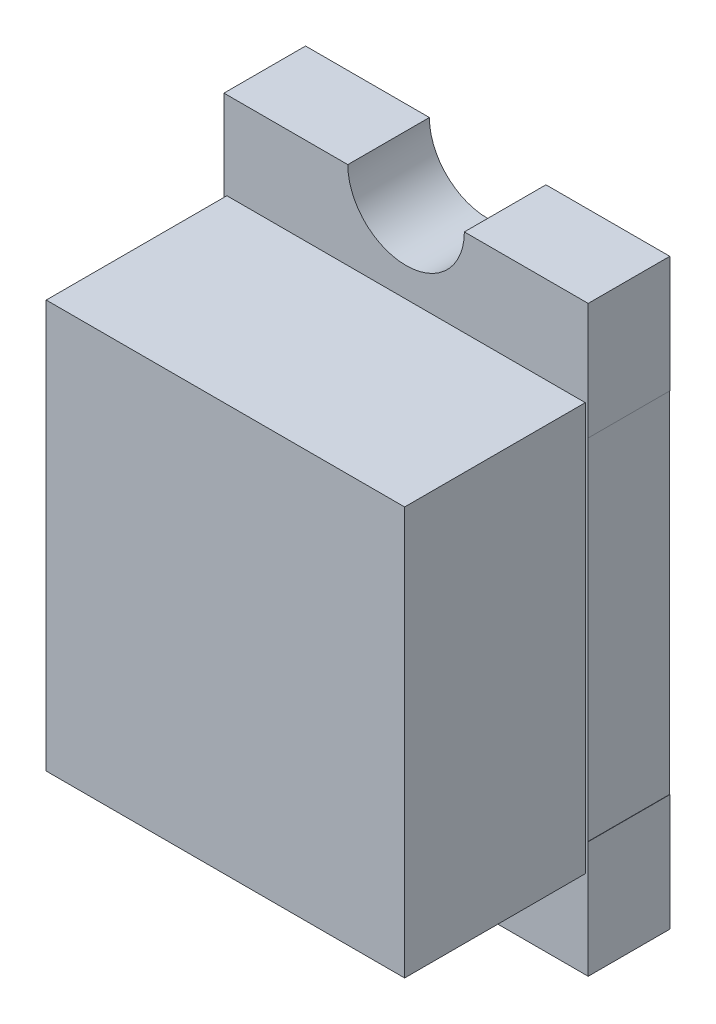
ISO-10303-21;
HEADER;
FILE_DESCRIPTION(('STEP AP214'),'2;1');
FILE_NAME('part.step','',(''),(''),'','','');
FILE_SCHEMA(('AUTOMOTIVE_DESIGN { 1 0 10303 214 1 1 1 1 }'));
ENDSEC;
DATA;
#1=APPLICATION_CONTEXT('core data for automotive mechanical design processes');
#2=APPLICATION_PROTOCOL_DEFINITION('international standard','automotive_design',2000,#1);
#3=PRODUCT_CONTEXT('',#1,'mechanical');
#4=PRODUCT('Part','Part','',(#3));
#5=PRODUCT_RELATED_PRODUCT_CATEGORY('part','',(#4));
#6=PRODUCT_DEFINITION_FORMATION('','',#4);
#7=PRODUCT_DEFINITION_CONTEXT('part definition',#1,'design');
#8=PRODUCT_DEFINITION('design','',#6,#7);
#9=PRODUCT_DEFINITION_SHAPE('','',#8);
#10=(LENGTH_UNIT() NAMED_UNIT(*) SI_UNIT(.MILLI.,.METRE.));
#11=(NAMED_UNIT(*) PLANE_ANGLE_UNIT() SI_UNIT($,.RADIAN.));
#12=(NAMED_UNIT(*) SI_UNIT($,.STERADIAN.) SOLID_ANGLE_UNIT());
#13=UNCERTAINTY_MEASURE_WITH_UNIT(LENGTH_MEASURE(1.E-05),#10,'distance_accuracy_value','');
#14=(GEOMETRIC_REPRESENTATION_CONTEXT(3) GLOBAL_UNCERTAINTY_ASSIGNED_CONTEXT((#13)) GLOBAL_UNIT_ASSIGNED_CONTEXT((#10,
#11,#12)) REPRESENTATION_CONTEXT('',''));
#15=CARTESIAN_POINT('',(0.,0.,0.));
#16=DIRECTION('',(0.,0.,1.));
#17=DIRECTION('',(1.,0.,0.));
#18=AXIS2_PLACEMENT_3D('',#15,#16,#17);
#19=CARTESIAN_POINT('',(0.,1.,0.));
#20=DIRECTION('',(0.,0.,1.));
#21=DIRECTION('',(0.,-1.,0.));
#22=AXIS2_PLACEMENT_3D('',#19,#20,#21);
#23=CYLINDRICAL_SURFACE('',#22,0.2);
#24=DIRECTION('',(0.,0.,1.));
#25=VECTOR('',#24,1.);
#26=CARTESIAN_POINT('',(-0.2,1.,0.));
#27=LINE('',#26,#25);
#28=CARTESIAN_POINT('',(-0.2,1.,0.));
#29=VERTEX_POINT('',#28);
#30=CARTESIAN_POINT('',(-0.2,1.,0.28));
#31=VERTEX_POINT('',#30);
#32=EDGE_CURVE('E455',#29,#31,#27,.T.);
#33=ORIENTED_EDGE('',*,*,#32,.T.);
#34=CARTESIAN_POINT('',(0.,1.,0.28));
#35=DIRECTION('',(0.,0.,1.));
#36=DIRECTION('',(0.,1.,0.));
#37=AXIS2_PLACEMENT_3D('',#34,#35,#36);
#38=CIRCLE('',#37,0.2);
#39=CARTESIAN_POINT('',(0.2,1.,0.28));
#40=VERTEX_POINT('',#39);
#41=EDGE_CURVE('E367',#31,#40,#38,.T.);
#42=ORIENTED_EDGE('',*,*,#41,.T.);
#43=DIRECTION('',(0.,0.,1.));
#44=VECTOR('',#43,1.);
#45=CARTESIAN_POINT('',(0.2,1.,0.));
#46=LINE('',#45,#44);
#47=CARTESIAN_POINT('',(0.2,1.,0.));
#48=VERTEX_POINT('',#47);
#49=EDGE_CURVE('E359',#48,#40,#46,.T.);
#50=ORIENTED_EDGE('',*,*,#49,.F.);
#51=CARTESIAN_POINT('',(0.,1.,0.));
#52=DIRECTION('',(0.,0.,1.));
#53=DIRECTION('',(0.,1.,0.));
#54=AXIS2_PLACEMENT_3D('',#51,#52,#53);
#55=CIRCLE('',#54,0.2);
#56=EDGE_CURVE('E294',#29,#48,#55,.T.);
#57=ORIENTED_EDGE('',*,*,#56,.F.);
#58=EDGE_LOOP('',(#33,#42,#50,#57));
#59=FACE_BOUND('',#58,.T.);
#60=ADVANCED_FACE('F16',(#59),#23,.F.);
#61=CARTESIAN_POINT('',(0.624,-0.6,1.480000416667));
#62=DIRECTION('',(0.,-1.,0.));
#63=DIRECTION('',(-1.,0.,0.));
#64=AXIS2_PLACEMENT_3D('',#61,#62,#63);
#65=PLANE('',#64);
#66=DIRECTION('',(0.,0.,-1.));
#67=VECTOR('',#66,1.);
#68=CARTESIAN_POINT('',(0.625,-0.6,1.480000416667));
#69=LINE('',#68,#67);
#70=CARTESIAN_POINT('',(0.625,-0.6,0.28));
#71=VERTEX_POINT('',#70);
#72=CARTESIAN_POINT('',(0.625,-0.6,0.));
#73=VERTEX_POINT('',#72);
#74=EDGE_CURVE('E265',#71,#73,#69,.T.);
#75=ORIENTED_EDGE('',*,*,#74,.T.);
#76=DIRECTION('',(-1.,0.,0.));
#77=VECTOR('',#76,1.);
#78=CARTESIAN_POINT('',(0.624,-0.6,0.));
#79=LINE('',#78,#77);
#80=CARTESIAN_POINT('',(0.624,-0.6,0.));
#81=VERTEX_POINT('',#80);
#82=EDGE_CURVE('E319',#73,#81,#79,.T.);
#83=ORIENTED_EDGE('',*,*,#82,.T.);
#84=DIRECTION('',(0.,0.,-1.));
#85=VECTOR('',#84,1.);
#86=CARTESIAN_POINT('',(0.624,-0.6,1.480000416667));
#87=LINE('',#86,#85);
#88=CARTESIAN_POINT('',(0.624,-0.6,0.28));
#89=VERTEX_POINT('',#88);
#90=EDGE_CURVE('E27',#89,#81,#87,.T.);
#91=ORIENTED_EDGE('',*,*,#90,.F.);
#92=DIRECTION('',(-1.,0.,0.));
#93=VECTOR('',#92,1.);
#94=CARTESIAN_POINT('',(0.624,-0.6,0.28));
#95=LINE('',#94,#93);
#96=EDGE_CURVE('E380',#71,#89,#95,.T.);
#97=ORIENTED_EDGE('',*,*,#96,.F.);
#98=EDGE_LOOP('',(#75,#83,#91,#97));
#99=FACE_BOUND('',#98,.T.);
#100=ADVANCED_FACE('F497',(#99),#65,.F.);
#101=CARTESIAN_POINT('',(0.624,0.6,1.480000416667));
#102=DIRECTION('',(0.,1.,0.));
#103=DIRECTION('',(1.,0.,0.));
#104=AXIS2_PLACEMENT_3D('',#101,#102,#103);
#105=PLANE('',#104);
#106=DIRECTION('',(0.,0.,-1.));
#107=VECTOR('',#106,1.);
#108=CARTESIAN_POINT('',(0.624,0.6,1.480000416667));
#109=LINE('',#108,#107);
#110=CARTESIAN_POINT('',(0.624,0.6,0.28));
#111=VERTEX_POINT('',#110);
#112=CARTESIAN_POINT('',(0.624,0.6,0.));
#113=VERTEX_POINT('',#112);
#114=EDGE_CURVE('E11',#111,#113,#109,.T.);
#115=ORIENTED_EDGE('',*,*,#114,.T.);
#116=DIRECTION('',(1.,0.,0.));
#117=VECTOR('',#116,1.);
#118=CARTESIAN_POINT('',(0.624,0.6,0.));
#119=LINE('',#118,#117);
#120=CARTESIAN_POINT('',(0.625,0.6,0.));
#121=VERTEX_POINT('',#120);
#122=EDGE_CURVE('E257',#113,#121,#119,.T.);
#123=ORIENTED_EDGE('',*,*,#122,.T.);
#124=DIRECTION('',(0.,0.,-1.));
#125=VECTOR('',#124,1.);
#126=CARTESIAN_POINT('',(0.625,0.6,1.480000416667));
#127=LINE('',#126,#125);
#128=CARTESIAN_POINT('',(0.625,0.6,0.28));
#129=VERTEX_POINT('',#128);
#130=EDGE_CURVE('E288',#129,#121,#127,.T.);
#131=ORIENTED_EDGE('',*,*,#130,.F.);
#132=DIRECTION('',(1.,0.,0.));
#133=VECTOR('',#132,1.);
#134=CARTESIAN_POINT('',(0.624,0.6,0.28));
#135=LINE('',#134,#133);
#136=EDGE_CURVE('E364',#111,#129,#135,.T.);
#137=ORIENTED_EDGE('',*,*,#136,.F.);
#138=EDGE_LOOP('',(#115,#123,#131,#137));
#139=FACE_BOUND('',#138,.T.);
#140=ADVANCED_FACE('F503',(#139),#105,.F.);
#141=CARTESIAN_POINT('',(0.624,0.6,1.480000416667));
#142=DIRECTION('',(-1.,0.,0.));
#143=DIRECTION('',(0.,0.,1.));
#144=AXIS2_PLACEMENT_3D('',#141,#142,#143);
#145=PLANE('',#144);
#146=ORIENTED_EDGE('',*,*,#90,.T.);
#147=DIRECTION('',(0.,1.,0.));
#148=VECTOR('',#147,1.);
#149=CARTESIAN_POINT('',(0.624,0.6,0.));
#150=LINE('',#149,#148);
#151=CARTESIAN_POINT('',(0.624,0.,0.));
#152=VERTEX_POINT('',#151);
#153=EDGE_CURVE('E303',#81,#152,#150,.T.);
#154=ORIENTED_EDGE('',*,*,#153,.T.);
#155=DIRECTION('',(0.,1.,0.));
#156=VECTOR('',#155,1.);
#157=CARTESIAN_POINT('',(0.624,0.6,0.));
#158=LINE('',#157,#156);
#159=CARTESIAN_POINT('',(0.624,0.416,0.));
#160=VERTEX_POINT('',#159);
#161=EDGE_CURVE('E215',#152,#160,#158,.T.);
#162=ORIENTED_EDGE('',*,*,#161,.T.);
#163=DIRECTION('',(0.,1.,0.));
#164=VECTOR('',#163,1.);
#165=CARTESIAN_POINT('',(0.624,0.6,0.));
#166=LINE('',#165,#164);
#167=EDGE_CURVE('E295',#160,#113,#166,.T.);
#168=ORIENTED_EDGE('',*,*,#167,.T.);
#169=ORIENTED_EDGE('',*,*,#114,.F.);
#170=DIRECTION('',(0.,1.,0.));
#171=VECTOR('',#170,1.);
#172=CARTESIAN_POINT('',(0.624,0.6,0.28));
#173=LINE('',#172,#171);
#174=EDGE_CURVE('E368',#89,#111,#173,.T.);
#175=ORIENTED_EDGE('',*,*,#174,.F.);
#176=EDGE_LOOP('',(#146,#154,#162,#168,#169,#175));
#177=FACE_BOUND('',#176,.T.);
#178=ADVANCED_FACE('F515',(#177),#145,.F.);
#179=CARTESIAN_POINT('',(-0.625,-0.6,1.480000416667));
#180=DIRECTION('',(0.,-1.,0.));
#181=DIRECTION('',(-1.,0.,0.));
#182=AXIS2_PLACEMENT_3D('',#179,#180,#181);
#183=PLANE('',#182);
#184=DIRECTION('',(0.,0.,-1.));
#185=VECTOR('',#184,1.);
#186=CARTESIAN_POINT('',(-0.624,-0.6,1.480000416667));
#187=LINE('',#186,#185);
#188=CARTESIAN_POINT('',(-0.624,-0.6,0.28));
#189=VERTEX_POINT('',#188);
#190=CARTESIAN_POINT('',(-0.624,-0.6,0.));
#191=VERTEX_POINT('',#190);
#192=EDGE_CURVE('E284',#189,#191,#187,.T.);
#193=ORIENTED_EDGE('',*,*,#192,.T.);
#194=DIRECTION('',(-1.,0.,0.));
#195=VECTOR('',#194,1.);
#196=CARTESIAN_POINT('',(-0.625,-0.6,0.));
#197=LINE('',#196,#195);
#198=CARTESIAN_POINT('',(-0.625,-0.6,0.));
#199=VERTEX_POINT('',#198);
#200=EDGE_CURVE('E324',#191,#199,#197,.T.);
#201=ORIENTED_EDGE('',*,*,#200,.T.);
#202=DIRECTION('',(0.,0.,-1.));
#203=VECTOR('',#202,1.);
#204=CARTESIAN_POINT('',(-0.625,-0.6,1.480000416667));
#205=LINE('',#204,#203);
#206=CARTESIAN_POINT('',(-0.625,-0.6,0.28));
#207=VERTEX_POINT('',#206);
#208=EDGE_CURVE('E280',#207,#199,#205,.T.);
#209=ORIENTED_EDGE('',*,*,#208,.F.);
#210=DIRECTION('',(-1.,0.,0.));
#211=VECTOR('',#210,1.);
#212=CARTESIAN_POINT('',(-0.625,-0.6,0.28));
#213=LINE('',#212,#211);
#214=EDGE_CURVE('E258',#189,#207,#213,.T.);
#215=ORIENTED_EDGE('',*,*,#214,.F.);
#216=EDGE_LOOP('',(#193,#201,#209,#215));
#217=FACE_BOUND('',#216,.T.);
#218=ADVANCED_FACE('F518',(#217),#183,.F.);
#219=CARTESIAN_POINT('',(-0.624,0.6,1.480000416667));
#220=DIRECTION('',(1.,0.,0.));
#221=DIRECTION('',(0.,-1.,0.));
#222=AXIS2_PLACEMENT_3D('',#219,#220,#221);
#223=PLANE('',#222);
#224=DIRECTION('',(0.,0.,-1.));
#225=VECTOR('',#224,1.);
#226=CARTESIAN_POINT('',(-0.624,0.6,1.480000416667));
#227=LINE('',#226,#225);
#228=CARTESIAN_POINT('',(-0.624,0.6,0.28));
#229=VERTEX_POINT('',#228);
#230=CARTESIAN_POINT('',(-0.624,0.6,0.));
#231=VERTEX_POINT('',#230);
#232=EDGE_CURVE('E85',#229,#231,#227,.T.);
#233=ORIENTED_EDGE('',*,*,#232,.T.);
#234=DIRECTION('',(0.,-1.,0.));
#235=VECTOR('',#234,1.);
#236=CARTESIAN_POINT('',(-0.624,0.6,0.));
#237=LINE('',#236,#235);
#238=CARTESIAN_POINT('',(-0.624,0.416,0.));
#239=VERTEX_POINT('',#238);
#240=EDGE_CURVE('E210',#231,#239,#237,.T.);
#241=ORIENTED_EDGE('',*,*,#240,.T.);
#242=DIRECTION('',(0.,-1.,0.));
#243=VECTOR('',#242,1.);
#244=CARTESIAN_POINT('',(-0.624,0.6,0.));
#245=LINE('',#244,#243);
#246=CARTESIAN_POINT('',(-0.624,0.,0.));
#247=VERTEX_POINT('',#246);
#248=EDGE_CURVE('E203',#239,#247,#245,.T.);
#249=ORIENTED_EDGE('',*,*,#248,.T.);
#250=DIRECTION('',(0.,-1.,0.));
#251=VECTOR('',#250,1.);
#252=CARTESIAN_POINT('',(-0.624,0.6,0.));
#253=LINE('',#252,#251);
#254=EDGE_CURVE('E207',#247,#191,#253,.T.);
#255=ORIENTED_EDGE('',*,*,#254,.T.);
#256=ORIENTED_EDGE('',*,*,#192,.F.);
#257=DIRECTION('',(0.,-1.,0.));
#258=VECTOR('',#257,1.);
#259=CARTESIAN_POINT('',(-0.624,0.6,0.28));
#260=LINE('',#259,#258);
#261=EDGE_CURVE('E261',#229,#189,#260,.T.);
#262=ORIENTED_EDGE('',*,*,#261,.F.);
#263=EDGE_LOOP('',(#233,#241,#249,#255,#256,#262));
#264=FACE_BOUND('',#263,.T.);
#265=ADVANCED_FACE('F205',(#264),#223,.F.);
#266=CARTESIAN_POINT('',(-0.625,0.6,1.480000416667));
#267=DIRECTION('',(0.,1.,0.));
#268=DIRECTION('',(1.,0.,0.));
#269=AXIS2_PLACEMENT_3D('',#266,#267,#268);
#270=PLANE('',#269);
#271=DIRECTION('',(0.,0.,-1.));
#272=VECTOR('',#271,1.);
#273=CARTESIAN_POINT('',(-0.625,0.6,1.480000416667));
#274=LINE('',#273,#272);
#275=CARTESIAN_POINT('',(-0.625,0.6,0.28));
#276=VERTEX_POINT('',#275);
#277=CARTESIAN_POINT('',(-0.625,0.6,0.));
#278=VERTEX_POINT('',#277);
#279=EDGE_CURVE('E285',#276,#278,#274,.T.);
#280=ORIENTED_EDGE('',*,*,#279,.T.);
#281=DIRECTION('',(1.,0.,0.));
#282=VECTOR('',#281,1.);
#283=CARTESIAN_POINT('',(-0.625,0.6,0.));
#284=LINE('',#283,#282);
#285=EDGE_CURVE('E253',#278,#231,#284,.T.);
#286=ORIENTED_EDGE('',*,*,#285,.T.);
#287=ORIENTED_EDGE('',*,*,#232,.F.);
#288=DIRECTION('',(1.,0.,0.));
#289=VECTOR('',#288,1.);
#290=CARTESIAN_POINT('',(-0.625,0.6,0.28));
#291=LINE('',#290,#289);
#292=EDGE_CURVE('E429',#276,#229,#291,.T.);
#293=ORIENTED_EDGE('',*,*,#292,.F.);
#294=EDGE_LOOP('',(#280,#286,#287,#293));
#295=FACE_BOUND('',#294,.T.);
#296=ADVANCED_FACE('F492',(#295),#270,.F.);
#297=CARTESIAN_POINT('',(0.,0.,0.9));
#298=DIRECTION('',(0.,0.,1.));
#299=DIRECTION('',(1.,0.,0.));
#300=AXIS2_PLACEMENT_3D('',#297,#298,#299);
#301=PLANE('',#300);
#302=DIRECTION('',(0.,-1.,0.));
#303=VECTOR('',#302,1.);
#304=CARTESIAN_POINT('',(-0.615,0.7,0.9));
#305=LINE('',#304,#303);
#306=CARTESIAN_POINT('',(-0.615,0.7,0.9));
#307=VERTEX_POINT('',#306);
#308=CARTESIAN_POINT('',(-0.615,-0.7,0.9));
#309=VERTEX_POINT('',#308);
#310=EDGE_CURVE('E246',#307,#309,#305,.T.);
#311=ORIENTED_EDGE('',*,*,#310,.T.);
#312=DIRECTION('',(1.,0.,0.));
#313=VECTOR('',#312,1.);
#314=CARTESIAN_POINT('',(0.615,-0.7,0.9));
#315=LINE('',#314,#313);
#316=CARTESIAN_POINT('',(0.615,-0.7,0.9));
#317=VERTEX_POINT('',#316);
#318=EDGE_CURVE('E277',#309,#317,#315,.T.);
#319=ORIENTED_EDGE('',*,*,#318,.T.);
#320=DIRECTION('',(0.,1.,0.));
#321=VECTOR('',#320,1.);
#322=CARTESIAN_POINT('',(0.615,-0.7,0.9));
#323=LINE('',#322,#321);
#324=CARTESIAN_POINT('',(0.615,0.7,0.9));
#325=VERTEX_POINT('',#324);
#326=EDGE_CURVE('E276',#317,#325,#323,.T.);
#327=ORIENTED_EDGE('',*,*,#326,.T.);
#328=DIRECTION('',(-1.,0.,0.));
#329=VECTOR('',#328,1.);
#330=CARTESIAN_POINT('',(-0.615,0.7,0.9));
#331=LINE('',#330,#329);
#332=EDGE_CURVE('E41',#325,#307,#331,.T.);
#333=ORIENTED_EDGE('',*,*,#332,.T.);
#334=EDGE_LOOP('',(#311,#319,#327,#333));
#335=FACE_BOUND('',#334,.T.);
#336=ADVANCED_FACE('F465',(#335),#301,.T.);
#337=CARTESIAN_POINT('',(-0.615,0.7,0.9));
#338=DIRECTION('',(0.,-1.,0.));
#339=DIRECTION('',(-1.,0.,0.));
#340=AXIS2_PLACEMENT_3D('',#337,#338,#339);
#341=PLANE('',#340);
#342=DIRECTION('',(-1.,0.,0.));
#343=VECTOR('',#342,1.);
#344=CARTESIAN_POINT('',(-0.615,0.7,0.28));
#345=LINE('',#344,#343);
#346=CARTESIAN_POINT('',(0.615,0.7,0.28));
#347=VERTEX_POINT('',#346);
#348=CARTESIAN_POINT('',(-0.615,0.7,0.28));
#349=VERTEX_POINT('',#348);
#350=EDGE_CURVE('E348',#347,#349,#345,.T.);
#351=ORIENTED_EDGE('',*,*,#350,.T.);
#352=DIRECTION('',(0.,0.,-1.));
#353=VECTOR('',#352,1.);
#354=CARTESIAN_POINT('',(-0.615,0.7,0.9));
#355=LINE('',#354,#353);
#356=EDGE_CURVE('E242',#307,#349,#355,.T.);
#357=ORIENTED_EDGE('',*,*,#356,.F.);
#358=ORIENTED_EDGE('',*,*,#332,.F.);
#359=DIRECTION('',(0.,0.,-1.));
#360=VECTOR('',#359,1.);
#361=CARTESIAN_POINT('',(0.615,0.7,0.9));
#362=LINE('',#361,#360);
#363=EDGE_CURVE('E273',#325,#347,#362,.T.);
#364=ORIENTED_EDGE('',*,*,#363,.T.);
#365=EDGE_LOOP('',(#351,#357,#358,#364));
#366=FACE_BOUND('',#365,.T.);
#367=ADVANCED_FACE('F483',(#366),#341,.F.);
#368=CARTESIAN_POINT('',(0.615,-0.7,0.9));
#369=DIRECTION('',(-1.,0.,0.));
#370=DIRECTION('',(0.,0.,1.));
#371=AXIS2_PLACEMENT_3D('',#368,#369,#370);
#372=PLANE('',#371);
#373=DIRECTION('',(0.,1.,0.));
#374=VECTOR('',#373,1.);
#375=CARTESIAN_POINT('',(0.615,-0.7,0.28));
#376=LINE('',#375,#374);
#377=CARTESIAN_POINT('',(0.615,-0.7,0.28));
#378=VERTEX_POINT('',#377);
#379=EDGE_CURVE('E272',#378,#347,#376,.T.);
#380=ORIENTED_EDGE('',*,*,#379,.T.);
#381=ORIENTED_EDGE('',*,*,#363,.F.);
#382=ORIENTED_EDGE('',*,*,#326,.F.);
#383=DIRECTION('',(0.,0.,-1.));
#384=VECTOR('',#383,1.);
#385=CARTESIAN_POINT('',(0.615,-0.7,0.9));
#386=LINE('',#385,#384);
#387=EDGE_CURVE('E245',#317,#378,#386,.T.);
#388=ORIENTED_EDGE('',*,*,#387,.T.);
#389=EDGE_LOOP('',(#380,#381,#382,#388));
#390=FACE_BOUND('',#389,.T.);
#391=ADVANCED_FACE('F480',(#390),#372,.F.);
#392=CARTESIAN_POINT('',(0.615,-0.7,0.9));
#393=DIRECTION('',(0.,1.,0.));
#394=DIRECTION('',(1.,0.,0.));
#395=AXIS2_PLACEMENT_3D('',#392,#393,#394);
#396=PLANE('',#395);
#397=DIRECTION('',(1.,0.,0.));
#398=VECTOR('',#397,1.);
#399=CARTESIAN_POINT('',(0.615,-0.7,0.28));
#400=LINE('',#399,#398);
#401=CARTESIAN_POINT('',(-0.615,-0.7,0.28));
#402=VERTEX_POINT('',#401);
#403=EDGE_CURVE('E267',#402,#378,#400,.T.);
#404=ORIENTED_EDGE('',*,*,#403,.T.);
#405=ORIENTED_EDGE('',*,*,#387,.F.);
#406=ORIENTED_EDGE('',*,*,#318,.F.);
#407=DIRECTION('',(0.,0.,-1.));
#408=VECTOR('',#407,1.);
#409=CARTESIAN_POINT('',(-0.615,-0.7,0.9));
#410=LINE('',#409,#408);
#411=EDGE_CURVE('E271',#309,#402,#410,.T.);
#412=ORIENTED_EDGE('',*,*,#411,.T.);
#413=EDGE_LOOP('',(#404,#405,#406,#412));
#414=FACE_BOUND('',#413,.T.);
#415=ADVANCED_FACE('F473',(#414),#396,.F.);
#416=CARTESIAN_POINT('',(-0.615,0.7,0.9));
#417=DIRECTION('',(1.,0.,0.));
#418=DIRECTION('',(0.,0.,1.));
#419=AXIS2_PLACEMENT_3D('',#416,#417,#418);
#420=PLANE('',#419);
#421=DIRECTION('',(0.,-1.,0.));
#422=VECTOR('',#421,1.);
#423=CARTESIAN_POINT('',(-0.615,0.7,0.28));
#424=LINE('',#423,#422);
#425=EDGE_CURVE('E20',#349,#402,#424,.T.);
#426=ORIENTED_EDGE('',*,*,#425,.T.);
#427=ORIENTED_EDGE('',*,*,#411,.F.);
#428=ORIENTED_EDGE('',*,*,#310,.F.);
#429=ORIENTED_EDGE('',*,*,#356,.T.);
#430=EDGE_LOOP('',(#426,#427,#428,#429));
#431=FACE_BOUND('',#430,.T.);
#432=ADVANCED_FACE('F469',(#431),#420,.F.);
#433=CARTESIAN_POINT('',(0.,0.,0.28));
#434=DIRECTION('',(0.,0.,1.));
#435=DIRECTION('',(1.,0.,0.));
#436=AXIS2_PLACEMENT_3D('',#433,#434,#435);
#437=PLANE('',#436);
#438=ORIENTED_EDGE('',*,*,#425,.F.);
#439=ORIENTED_EDGE('',*,*,#350,.F.);
#440=ORIENTED_EDGE('',*,*,#379,.F.);
#441=ORIENTED_EDGE('',*,*,#403,.F.);
#442=EDGE_LOOP('',(#438,#439,#440,#441));
#443=FACE_BOUND('',#442,.T.);
#444=CARTESIAN_POINT('',(0.,-1.,0.28));
#445=DIRECTION('',(0.,0.,1.));
#446=DIRECTION('',(0.,1.,0.));
#447=AXIS2_PLACEMENT_3D('',#444,#445,#446);
#448=CIRCLE('',#447,0.2);
#449=CARTESIAN_POINT('',(0.2,-1.,0.28));
#450=VERTEX_POINT('',#449);
#451=CARTESIAN_POINT('',(-0.2,-1.,0.28));
#452=VERTEX_POINT('',#451);
#453=EDGE_CURVE('E347',#450,#452,#448,.T.);
#454=ORIENTED_EDGE('',*,*,#453,.F.);
#455=DIRECTION('',(1.,0.,0.));
#456=VECTOR('',#455,1.);
#457=CARTESIAN_POINT('',(-0.625,-1.,0.28));
#458=LINE('',#457,#456);
#459=CARTESIAN_POINT('',(0.625,-1.,0.28));
#460=VERTEX_POINT('',#459);
#461=EDGE_CURVE('E266',#450,#460,#458,.T.);
#462=ORIENTED_EDGE('',*,*,#461,.T.);
#463=DIRECTION('',(0.,1.,0.));
#464=VECTOR('',#463,1.);
#465=CARTESIAN_POINT('',(0.625,-1.,0.28));
#466=LINE('',#465,#464);
#467=EDGE_CURVE('E216',#460,#71,#466,.T.);
#468=ORIENTED_EDGE('',*,*,#467,.T.);
#469=ORIENTED_EDGE('',*,*,#96,.T.);
#470=ORIENTED_EDGE('',*,*,#174,.T.);
#471=ORIENTED_EDGE('',*,*,#136,.T.);
#472=DIRECTION('',(0.,1.,0.));
#473=VECTOR('',#472,1.);
#474=CARTESIAN_POINT('',(0.625,-1.,0.28));
#475=LINE('',#474,#473);
#476=CARTESIAN_POINT('',(0.625,1.,0.28));
#477=VERTEX_POINT('',#476);
#478=EDGE_CURVE('E328',#129,#477,#475,.T.);
#479=ORIENTED_EDGE('',*,*,#478,.T.);
#480=DIRECTION('',(-1.,0.,0.));
#481=VECTOR('',#480,1.);
#482=CARTESIAN_POINT('',(0.625,1.,0.28));
#483=LINE('',#482,#481);
#484=EDGE_CURVE('E355',#477,#40,#483,.T.);
#485=ORIENTED_EDGE('',*,*,#484,.T.);
#486=ORIENTED_EDGE('',*,*,#41,.F.);
#487=DIRECTION('',(-1.,0.,0.));
#488=VECTOR('',#487,1.);
#489=CARTESIAN_POINT('',(0.625,1.,0.28));
#490=LINE('',#489,#488);
#491=CARTESIAN_POINT('',(-0.625,1.,0.28));
#492=VERTEX_POINT('',#491);
#493=EDGE_CURVE('E452',#31,#492,#490,.T.);
#494=ORIENTED_EDGE('',*,*,#493,.T.);
#495=DIRECTION('',(0.,-1.,0.));
#496=VECTOR('',#495,1.);
#497=CARTESIAN_POINT('',(-0.625,1.,0.28));
#498=LINE('',#497,#496);
#499=EDGE_CURVE('E287',#492,#276,#498,.T.);
#500=ORIENTED_EDGE('',*,*,#499,.T.);
#501=ORIENTED_EDGE('',*,*,#292,.T.);
#502=ORIENTED_EDGE('',*,*,#261,.T.);
#503=ORIENTED_EDGE('',*,*,#214,.T.);
#504=DIRECTION('',(0.,-1.,0.));
#505=VECTOR('',#504,1.);
#506=CARTESIAN_POINT('',(-0.625,1.,0.28));
#507=LINE('',#506,#505);
#508=CARTESIAN_POINT('',(-0.625,-1.,0.28));
#509=VERTEX_POINT('',#508);
#510=EDGE_CURVE('E418',#207,#509,#507,.T.);
#511=ORIENTED_EDGE('',*,*,#510,.T.);
#512=DIRECTION('',(1.,0.,0.));
#513=VECTOR('',#512,1.);
#514=CARTESIAN_POINT('',(-0.625,-1.,0.28));
#515=LINE('',#514,#513);
#516=EDGE_CURVE('E343',#509,#452,#515,.T.);
#517=ORIENTED_EDGE('',*,*,#516,.T.);
#518=EDGE_LOOP('',(#454,#462,#468,#469,#470,#471,#479,#485,#486,#494,#500,#501,#502,#503,#511,#517));
#519=FACE_BOUND('',#518,.T.);
#520=ADVANCED_FACE('F476',(#443,#519),#437,.T.);
#521=CARTESIAN_POINT('',(0.,0.,0.));
#522=DIRECTION('',(0.,0.,1.));
#523=DIRECTION('',(1.,0.,0.));
#524=AXIS2_PLACEMENT_3D('',#521,#522,#523);
#525=PLANE('',#524);
#526=ORIENTED_EDGE('',*,*,#248,.F.);
#527=DIRECTION('',(1.,0.,0.));
#528=VECTOR('',#527,1.);
#529=CARTESIAN_POINT('',(0.,0.416,0.));
#530=LINE('',#529,#528);
#531=EDGE_CURVE('E298',#239,#160,#530,.T.);
#532=ORIENTED_EDGE('',*,*,#531,.T.);
#533=ORIENTED_EDGE('',*,*,#161,.F.);
#534=DIRECTION('',(-1.,0.,0.));
#535=VECTOR('',#534,1.);
#536=CARTESIAN_POINT('',(0.,0.,0.));
#537=LINE('',#536,#535);
#538=CARTESIAN_POINT('',(0.208,0.,0.));
#539=VERTEX_POINT('',#538);
#540=EDGE_CURVE('E300',#152,#539,#537,.T.);
#541=ORIENTED_EDGE('',*,*,#540,.T.);
#542=DIRECTION('',(0.,-1.,0.));
#543=VECTOR('',#542,1.);
#544=CARTESIAN_POINT('',(0.208,0.,0.));
#545=LINE('',#544,#543);
#546=CARTESIAN_POINT('',(0.208,-0.416,0.));
#547=VERTEX_POINT('',#546);
#548=EDGE_CURVE('E304',#539,#547,#545,.T.);
#549=ORIENTED_EDGE('',*,*,#548,.T.);
#550=DIRECTION('',(-1.,0.,0.));
#551=VECTOR('',#550,1.);
#552=CARTESIAN_POINT('',(0.,-0.416,0.));
#553=LINE('',#552,#551);
#554=CARTESIAN_POINT('',(-0.208,-0.416,0.));
#555=VERTEX_POINT('',#554);
#556=EDGE_CURVE('E307',#547,#555,#553,.T.);
#557=ORIENTED_EDGE('',*,*,#556,.T.);
#558=DIRECTION('',(0.,1.,0.));
#559=VECTOR('',#558,1.);
#560=CARTESIAN_POINT('',(-0.208,0.,0.));
#561=LINE('',#560,#559);
#562=CARTESIAN_POINT('',(-0.208,0.,0.));
#563=VERTEX_POINT('',#562);
#564=EDGE_CURVE('E222',#555,#563,#561,.T.);
#565=ORIENTED_EDGE('',*,*,#564,.T.);
#566=DIRECTION('',(-1.,0.,0.));
#567=VECTOR('',#566,1.);
#568=CARTESIAN_POINT('',(0.,0.,0.));
#569=LINE('',#568,#567);
#570=EDGE_CURVE('E219',#563,#247,#569,.T.);
#571=ORIENTED_EDGE('',*,*,#570,.T.);
#572=EDGE_LOOP('',(#526,#532,#533,#541,#549,#557,#565,#571));
#573=FACE_BOUND('',#572,.T.);
#574=ADVANCED_FACE('F220',(#573),#525,.F.);
#575=CARTESIAN_POINT('',(0.625,-1.,0.9));
#576=DIRECTION('',(-1.,0.,0.));
#577=DIRECTION('',(0.,0.,1.));
#578=AXIS2_PLACEMENT_3D('',#575,#576,#577);
#579=PLANE('',#578);
#580=DIRECTION('',(0.,1.,0.));
#581=VECTOR('',#580,1.);
#582=CARTESIAN_POINT('',(0.625,-1.,0.));
#583=LINE('',#582,#581);
#584=CARTESIAN_POINT('',(0.625,-1.,0.));
#585=VERTEX_POINT('',#584);
#586=EDGE_CURVE('E323',#585,#73,#583,.T.);
#587=ORIENTED_EDGE('',*,*,#586,.T.);
#588=ORIENTED_EDGE('',*,*,#74,.F.);
#589=ORIENTED_EDGE('',*,*,#467,.F.);
#590=DIRECTION('',(0.,0.,-1.));
#591=VECTOR('',#590,1.);
#592=CARTESIAN_POINT('',(0.625,-1.,0.9));
#593=LINE('',#592,#591);
#594=EDGE_CURVE('E262',#460,#585,#593,.T.);
#595=ORIENTED_EDGE('',*,*,#594,.T.);
#596=EDGE_LOOP('',(#587,#588,#589,#595));
#597=FACE_BOUND('',#596,.T.);
#598=ADVANCED_FACE('F853',(#597),#579,.F.);
#599=CARTESIAN_POINT('',(-0.625,-1.,0.9));
#600=DIRECTION('',(0.,1.,0.));
#601=DIRECTION('',(0.,0.,-1.));
#602=AXIS2_PLACEMENT_3D('',#599,#600,#601);
#603=PLANE('',#602);
#604=ORIENTED_EDGE('',*,*,#461,.F.);
#605=DIRECTION('',(0.,0.,1.));
#606=VECTOR('',#605,1.);
#607=CARTESIAN_POINT('',(0.2,-1.,0.));
#608=LINE('',#607,#606);
#609=CARTESIAN_POINT('',(0.2,-1.,0.));
#610=VERTEX_POINT('',#609);
#611=EDGE_CURVE('E251',#610,#450,#608,.T.);
#612=ORIENTED_EDGE('',*,*,#611,.F.);
#613=DIRECTION('',(1.,0.,0.));
#614=VECTOR('',#613,1.);
#615=CARTESIAN_POINT('',(-0.625,-1.,0.));
#616=LINE('',#615,#614);
#617=EDGE_CURVE('E399',#610,#585,#616,.T.);
#618=ORIENTED_EDGE('',*,*,#617,.T.);
#619=ORIENTED_EDGE('',*,*,#594,.F.);
#620=EDGE_LOOP('',(#604,#612,#618,#619));
#621=FACE_BOUND('',#620,.T.);
#622=ADVANCED_FACE('F858',(#621),#603,.F.);
#623=CARTESIAN_POINT('',(-0.625,-1.,0.9));
#624=DIRECTION('',(1.,0.,0.));
#625=DIRECTION('',(0.,-1.,0.));
#626=AXIS2_PLACEMENT_3D('',#623,#624,#625);
#627=PLANE('',#626);
#628=ORIENTED_EDGE('',*,*,#510,.F.);
#629=ORIENTED_EDGE('',*,*,#208,.T.);
#630=DIRECTION('',(0.,-1.,0.));
#631=VECTOR('',#630,1.);
#632=CARTESIAN_POINT('',(-0.625,-1.,0.));
#633=LINE('',#632,#631);
#634=CARTESIAN_POINT('',(-0.625,-1.,0.));
#635=VERTEX_POINT('',#634);
#636=EDGE_CURVE('E240',#199,#635,#633,.T.);
#637=ORIENTED_EDGE('',*,*,#636,.T.);
#638=DIRECTION('',(0.,0.,-1.));
#639=VECTOR('',#638,1.);
#640=CARTESIAN_POINT('',(-0.625,-1.,0.9));
#641=LINE('',#640,#639);
#642=EDGE_CURVE('E338',#509,#635,#641,.T.);
#643=ORIENTED_EDGE('',*,*,#642,.F.);
#644=EDGE_LOOP('',(#628,#629,#637,#643));
#645=FACE_BOUND('',#644,.T.);
#646=ADVANCED_FACE('F542',(#645),#627,.F.);
#647=CARTESIAN_POINT('',(-0.625,1.,0.9));
#648=DIRECTION('',(0.,-1.,0.));
#649=DIRECTION('',(-1.,0.,0.));
#650=AXIS2_PLACEMENT_3D('',#647,#648,#649);
#651=PLANE('',#650);
#652=ORIENTED_EDGE('',*,*,#493,.F.);
#653=ORIENTED_EDGE('',*,*,#32,.F.);
#654=DIRECTION('',(-1.,0.,0.));
#655=VECTOR('',#654,1.);
#656=CARTESIAN_POINT('',(-0.625,1.,0.));
#657=LINE('',#656,#655);
#658=CARTESIAN_POINT('',(-0.625,1.,0.));
#659=VERTEX_POINT('',#658);
#660=EDGE_CURVE('E290',#29,#659,#657,.T.);
#661=ORIENTED_EDGE('',*,*,#660,.T.);
#662=DIRECTION('',(0.,0.,-1.));
#663=VECTOR('',#662,1.);
#664=CARTESIAN_POINT('',(-0.625,1.,0.9));
#665=LINE('',#664,#663);
#666=EDGE_CURVE('E334',#492,#659,#665,.T.);
#667=ORIENTED_EDGE('',*,*,#666,.F.);
#668=EDGE_LOOP('',(#652,#653,#661,#667));
#669=FACE_BOUND('',#668,.T.);
#670=ADVANCED_FACE('F534',(#669),#651,.F.);
#671=CARTESIAN_POINT('',(-0.625,-1.,0.9));
#672=DIRECTION('',(1.,0.,0.));
#673=DIRECTION('',(0.,-1.,0.));
#674=AXIS2_PLACEMENT_3D('',#671,#672,#673);
#675=PLANE('',#674);
#676=DIRECTION('',(0.,-1.,0.));
#677=VECTOR('',#676,1.);
#678=CARTESIAN_POINT('',(-0.625,-1.,0.));
#679=LINE('',#678,#677);
#680=EDGE_CURVE('E256',#659,#278,#679,.T.);
#681=ORIENTED_EDGE('',*,*,#680,.T.);
#682=ORIENTED_EDGE('',*,*,#279,.F.);
#683=ORIENTED_EDGE('',*,*,#499,.F.);
#684=ORIENTED_EDGE('',*,*,#666,.T.);
#685=EDGE_LOOP('',(#681,#682,#683,#684));
#686=FACE_BOUND('',#685,.T.);
#687=ADVANCED_FACE('F532',(#686),#675,.F.);
#688=CARTESIAN_POINT('',(0.625,-1.,0.9));
#689=DIRECTION('',(-1.,0.,0.));
#690=DIRECTION('',(0.,0.,1.));
#691=AXIS2_PLACEMENT_3D('',#688,#689,#690);
#692=PLANE('',#691);
#693=ORIENTED_EDGE('',*,*,#478,.F.);
#694=ORIENTED_EDGE('',*,*,#130,.T.);
#695=DIRECTION('',(0.,1.,0.));
#696=VECTOR('',#695,1.);
#697=CARTESIAN_POINT('',(0.625,-1.,0.));
#698=LINE('',#697,#696);
#699=CARTESIAN_POINT('',(0.625,1.,0.));
#700=VERTEX_POINT('',#699);
#701=EDGE_CURVE('E318',#121,#700,#698,.T.);
#702=ORIENTED_EDGE('',*,*,#701,.T.);
#703=DIRECTION('',(0.,0.,-1.));
#704=VECTOR('',#703,1.);
#705=CARTESIAN_POINT('',(0.625,1.,0.9));
#706=LINE('',#705,#704);
#707=EDGE_CURVE('E236',#477,#700,#706,.T.);
#708=ORIENTED_EDGE('',*,*,#707,.F.);
#709=EDGE_LOOP('',(#693,#694,#702,#708));
#710=FACE_BOUND('',#709,.T.);
#711=ADVANCED_FACE('F525',(#710),#692,.F.);
#712=CARTESIAN_POINT('',(0.,0.,0.));
#713=DIRECTION('',(0.,0.,1.));
#714=DIRECTION('',(1.,0.,0.));
#715=AXIS2_PLACEMENT_3D('',#712,#713,#714);
#716=PLANE('',#715);
#717=ORIENTED_EDGE('',*,*,#617,.F.);
#718=CARTESIAN_POINT('',(0.,-1.,0.));
#719=DIRECTION('',(0.,0.,1.));
#720=DIRECTION('',(0.,1.,0.));
#721=AXIS2_PLACEMENT_3D('',#718,#719,#720);
#722=CIRCLE('',#721,0.2);
#723=CARTESIAN_POINT('',(-0.2,-1.,0.));
#724=VERTEX_POINT('',#723);
#725=EDGE_CURVE('E247',#610,#724,#722,.T.);
#726=ORIENTED_EDGE('',*,*,#725,.T.);
#727=DIRECTION('',(1.,0.,0.));
#728=VECTOR('',#727,1.);
#729=CARTESIAN_POINT('',(-0.625,-1.,0.));
#730=LINE('',#729,#728);
#731=EDGE_CURVE('E344',#635,#724,#730,.T.);
#732=ORIENTED_EDGE('',*,*,#731,.F.);
#733=ORIENTED_EDGE('',*,*,#636,.F.);
#734=ORIENTED_EDGE('',*,*,#200,.F.);
#735=DIRECTION('',(1.,0.,0.));
#736=VECTOR('',#735,1.);
#737=CARTESIAN_POINT('',(0.,-0.6,0.));
#738=LINE('',#737,#736);
#739=EDGE_CURVE('E229',#191,#81,#738,.T.);
#740=ORIENTED_EDGE('',*,*,#739,.T.);
#741=ORIENTED_EDGE('',*,*,#82,.F.);
#742=ORIENTED_EDGE('',*,*,#586,.F.);
#743=EDGE_LOOP('',(#717,#726,#732,#733,#734,#740,#741,#742));
#744=FACE_BOUND('',#743,.T.);
#745=ADVANCED_FACE('F522',(#744),#716,.F.);
#746=CARTESIAN_POINT('',(0.,0.,0.));
#747=DIRECTION('',(0.,0.,1.));
#748=DIRECTION('',(1.,0.,0.));
#749=AXIS2_PLACEMENT_3D('',#746,#747,#748);
#750=PLANE('',#749);
#751=ORIENTED_EDGE('',*,*,#660,.F.);
#752=ORIENTED_EDGE('',*,*,#56,.T.);
#753=DIRECTION('',(-1.,0.,0.));
#754=VECTOR('',#753,1.);
#755=CARTESIAN_POINT('',(-0.625,1.,0.));
#756=LINE('',#755,#754);
#757=EDGE_CURVE('E342',#700,#48,#756,.T.);
#758=ORIENTED_EDGE('',*,*,#757,.F.);
#759=ORIENTED_EDGE('',*,*,#701,.F.);
#760=ORIENTED_EDGE('',*,*,#122,.F.);
#761=DIRECTION('',(-1.,0.,0.));
#762=VECTOR('',#761,1.);
#763=CARTESIAN_POINT('',(0.,0.6,0.));
#764=LINE('',#763,#762);
#765=EDGE_CURVE('E299',#113,#231,#764,.T.);
#766=ORIENTED_EDGE('',*,*,#765,.T.);
#767=ORIENTED_EDGE('',*,*,#285,.F.);
#768=ORIENTED_EDGE('',*,*,#680,.F.);
#769=EDGE_LOOP('',(#751,#752,#758,#759,#760,#766,#767,#768));
#770=FACE_BOUND('',#769,.T.);
#771=ADVANCED_FACE('F18',(#770),#750,.F.);
#772=CARTESIAN_POINT('',(0.,0.,0.));
#773=DIRECTION('',(0.,0.,1.));
#774=DIRECTION('',(1.,0.,0.));
#775=AXIS2_PLACEMENT_3D('',#772,#773,#774);
#776=PLANE('',#775);
#777=ORIENTED_EDGE('',*,*,#765,.F.);
#778=ORIENTED_EDGE('',*,*,#167,.F.);
#779=ORIENTED_EDGE('',*,*,#531,.F.);
#780=ORIENTED_EDGE('',*,*,#240,.F.);
#781=EDGE_LOOP('',(#777,#778,#779,#780));
#782=FACE_BOUND('',#781,.T.);
#783=ADVANCED_FACE('F555',(#782),#776,.F.);
#784=CARTESIAN_POINT('',(0.,0.,0.));
#785=DIRECTION('',(0.,0.,1.));
#786=DIRECTION('',(1.,0.,0.));
#787=AXIS2_PLACEMENT_3D('',#784,#785,#786);
#788=PLANE('',#787);
#789=ORIENTED_EDGE('',*,*,#739,.F.);
#790=ORIENTED_EDGE('',*,*,#254,.F.);
#791=ORIENTED_EDGE('',*,*,#570,.F.);
#792=ORIENTED_EDGE('',*,*,#564,.F.);
#793=ORIENTED_EDGE('',*,*,#556,.F.);
#794=ORIENTED_EDGE('',*,*,#548,.F.);
#795=ORIENTED_EDGE('',*,*,#540,.F.);
#796=ORIENTED_EDGE('',*,*,#153,.F.);
#797=EDGE_LOOP('',(#789,#790,#791,#792,#793,#794,#795,#796));
#798=FACE_BOUND('',#797,.T.);
#799=ADVANCED_FACE('F226',(#798),#788,.F.);
#800=CARTESIAN_POINT('',(-0.625,1.,0.9));
#801=DIRECTION('',(0.,-1.,0.));
#802=DIRECTION('',(-1.,0.,0.));
#803=AXIS2_PLACEMENT_3D('',#800,#801,#802);
#804=PLANE('',#803);
#805=ORIENTED_EDGE('',*,*,#757,.T.);
#806=ORIENTED_EDGE('',*,*,#49,.T.);
#807=ORIENTED_EDGE('',*,*,#484,.F.);
#808=ORIENTED_EDGE('',*,*,#707,.T.);
#809=EDGE_LOOP('',(#805,#806,#807,#808));
#810=FACE_BOUND('',#809,.T.);
#811=ADVANCED_FACE('F508',(#810),#804,.F.);
#812=CARTESIAN_POINT('',(-0.625,-1.,0.9));
#813=DIRECTION('',(0.,1.,0.));
#814=DIRECTION('',(0.,0.,-1.));
#815=AXIS2_PLACEMENT_3D('',#812,#813,#814);
#816=PLANE('',#815);
#817=ORIENTED_EDGE('',*,*,#731,.T.);
#818=DIRECTION('',(0.,0.,1.));
#819=VECTOR('',#818,1.);
#820=CARTESIAN_POINT('',(-0.2,-1.,0.));
#821=LINE('',#820,#819);
#822=EDGE_CURVE('E252',#724,#452,#821,.T.);
#823=ORIENTED_EDGE('',*,*,#822,.T.);
#824=ORIENTED_EDGE('',*,*,#516,.F.);
#825=ORIENTED_EDGE('',*,*,#642,.T.);
#826=EDGE_LOOP('',(#817,#823,#824,#825));
#827=FACE_BOUND('',#826,.T.);
#828=ADVANCED_FACE('F511',(#827),#816,.F.);
#829=CARTESIAN_POINT('',(0.,-1.,0.));
#830=DIRECTION('',(0.,0.,1.));
#831=DIRECTION('',(0.,1.,0.));
#832=AXIS2_PLACEMENT_3D('',#829,#830,#831);
#833=CYLINDRICAL_SURFACE('',#832,0.2);
#834=ORIENTED_EDGE('',*,*,#822,.F.);
#835=ORIENTED_EDGE('',*,*,#725,.F.);
#836=ORIENTED_EDGE('',*,*,#611,.T.);
#837=ORIENTED_EDGE('',*,*,#453,.T.);
#838=EDGE_LOOP('',(#834,#835,#836,#837));
#839=FACE_BOUND('',#838,.T.);
#840=ADVANCED_FACE('F527',(#839),#833,.F.);
#841=CLOSED_SHELL('',(#60,#100,#140,#178,#218,#265,#296,#336,#367,#391,#415,#432,#520,#574,#598,
#622,#646,#670,#687,#711,#745,#771,#783,#799,#811,#828,#840));
#842=MANIFOLD_SOLID_BREP('B1',#841);
#843=ADVANCED_BREP_SHAPE_REPRESENTATION('',(#18,#842),#14);
#844=SHAPE_DEFINITION_REPRESENTATION(#9,#843);
ENDSEC;
END-ISO-10303-21;
